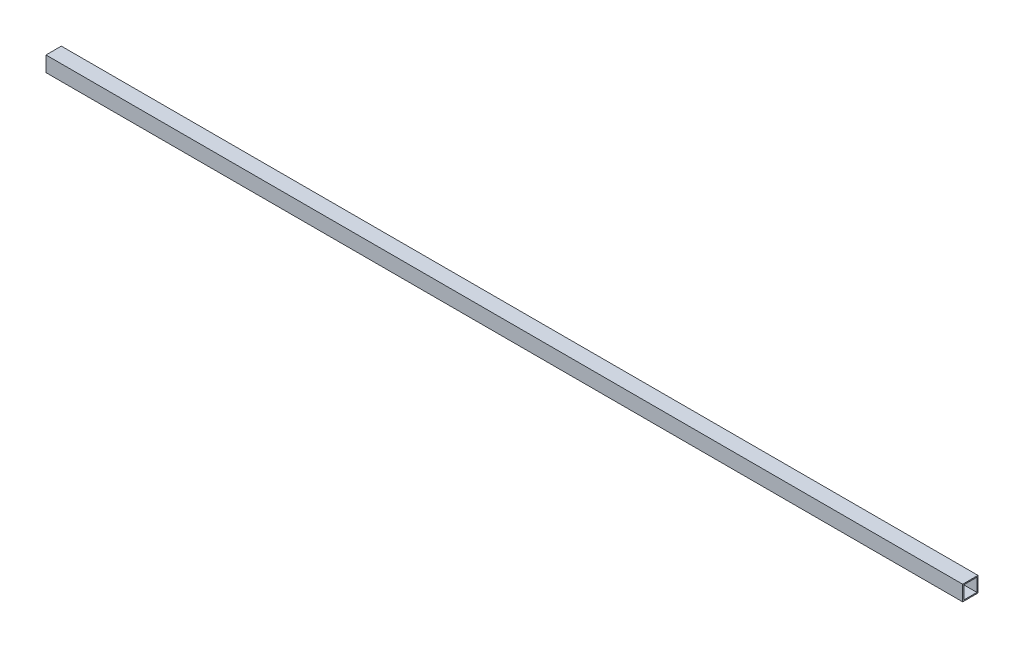
ISO-10303-21;
HEADER;
FILE_DESCRIPTION(('STEP AP214'),'2;1');
FILE_NAME('part.step','',(''),(''),'','','');
FILE_SCHEMA(('AUTOMOTIVE_DESIGN { 1 0 10303 214 1 1 1 1 }'));
ENDSEC;
DATA;
#1=APPLICATION_CONTEXT('core data for automotive mechanical design processes');
#2=APPLICATION_PROTOCOL_DEFINITION('international standard','automotive_design',2000,#1);
#3=PRODUCT_CONTEXT('',#1,'mechanical');
#4=PRODUCT('Part','Part','',(#3));
#5=PRODUCT_RELATED_PRODUCT_CATEGORY('part','',(#4));
#6=PRODUCT_DEFINITION_FORMATION('','',#4);
#7=PRODUCT_DEFINITION_CONTEXT('part definition',#1,'design');
#8=PRODUCT_DEFINITION('design','',#6,#7);
#9=PRODUCT_DEFINITION_SHAPE('','',#8);
#10=(LENGTH_UNIT() NAMED_UNIT(*) SI_UNIT(.MILLI.,.METRE.));
#11=(NAMED_UNIT(*) PLANE_ANGLE_UNIT() SI_UNIT($,.RADIAN.));
#12=(NAMED_UNIT(*) SI_UNIT($,.STERADIAN.) SOLID_ANGLE_UNIT());
#13=UNCERTAINTY_MEASURE_WITH_UNIT(LENGTH_MEASURE(1.E-05),#10,'distance_accuracy_value','');
#14=(GEOMETRIC_REPRESENTATION_CONTEXT(3) GLOBAL_UNCERTAINTY_ASSIGNED_CONTEXT((#13)) GLOBAL_UNIT_ASSIGNED_CONTEXT((#10,
#11,#12)) REPRESENTATION_CONTEXT('',''));
#15=CARTESIAN_POINT('',(0.,0.,0.));
#16=DIRECTION('',(0.,0.,1.));
#17=DIRECTION('',(1.,0.,0.));
#18=AXIS2_PLACEMENT_3D('',#15,#16,#17);
#19=CARTESIAN_POINT('',(2657.475,22.2250000000005,-22.225));
#20=DIRECTION('',(1.,0.,0.));
#21=DIRECTION('',(0.,1.,0.));
#22=AXIS2_PLACEMENT_3D('',#19,#20,#21);
#23=PLANE('',#22);
#24=DIRECTION('',(0.,1.,0.));
#25=VECTOR('',#24,1.);
#26=CARTESIAN_POINT('',(2657.475,22.2250000000005,0.));
#27=LINE('',#26,#25);
#28=CARTESIAN_POINT('',(2657.475,-1.94289029309402E-13,0.));
#29=VERTEX_POINT('',#28);
#30=CARTESIAN_POINT('',(2657.475,44.4500000000003,0.));
#31=VERTEX_POINT('',#30);
#32=EDGE_CURVE('E142',#29,#31,#27,.T.);
#33=ORIENTED_EDGE('',*,*,#32,.F.);
#34=DIRECTION('',(0.,0.,-1.));
#35=VECTOR('',#34,1.);
#36=CARTESIAN_POINT('',(2657.475,2.77555756156289E-13,-22.225));
#37=LINE('',#36,#35);
#38=CARTESIAN_POINT('',(2657.475,2.77555756156289E-13,-44.45));
#39=VERTEX_POINT('',#38);
#40=EDGE_CURVE('E146',#29,#39,#37,.T.);
#41=ORIENTED_EDGE('',*,*,#40,.T.);
#42=DIRECTION('',(0.,1.,0.));
#43=VECTOR('',#42,1.);
#44=CARTESIAN_POINT('',(2657.475,22.2250000000005,-44.45));
#45=LINE('',#44,#43);
#46=CARTESIAN_POINT('',(2657.475,44.4500000000004,-44.45));
#47=VERTEX_POINT('',#46);
#48=EDGE_CURVE('E150',#39,#47,#45,.T.);
#49=ORIENTED_EDGE('',*,*,#48,.T.);
#50=DIRECTION('',(0.,0.,-1.));
#51=VECTOR('',#50,1.);
#52=CARTESIAN_POINT('',(2657.475,44.4500000000005,-22.225));
#53=LINE('',#52,#51);
#54=EDGE_CURVE('E153',#31,#47,#53,.T.);
#55=ORIENTED_EDGE('',*,*,#54,.F.);
#56=EDGE_LOOP('',(#33,#41,#49,#55));
#57=FACE_BOUND('',#56,.T.);
#58=DIRECTION('',(0.,0.,-1.));
#59=VECTOR('',#58,1.);
#60=CARTESIAN_POINT('',(2657.475,3.17500000000029,-22.225));
#61=LINE('',#60,#59);
#62=CARTESIAN_POINT('',(2657.475,3.17500000000001,-3.17500000000004));
#63=VERTEX_POINT('',#62);
#64=CARTESIAN_POINT('',(2657.475,3.17500000000026,-41.275));
#65=VERTEX_POINT('',#64);
#66=EDGE_CURVE('E129',#63,#65,#61,.T.);
#67=ORIENTED_EDGE('',*,*,#66,.F.);
#68=DIRECTION('',(0.,1.,0.));
#69=VECTOR('',#68,1.);
#70=CARTESIAN_POINT('',(2657.475,22.2250000000005,-3.17500000000004));
#71=LINE('',#70,#69);
#72=CARTESIAN_POINT('',(2657.475,41.2750000000003,-3.17500000000004));
#73=VERTEX_POINT('',#72);
#74=EDGE_CURVE('E123',#63,#73,#71,.T.);
#75=ORIENTED_EDGE('',*,*,#74,.T.);
#76=DIRECTION('',(0.,0.,-1.));
#77=VECTOR('',#76,1.);
#78=CARTESIAN_POINT('',(2657.475,41.2750000000005,-22.225));
#79=LINE('',#78,#77);
#80=CARTESIAN_POINT('',(2657.475,41.2750000000004,-41.275));
#81=VERTEX_POINT('',#80);
#82=EDGE_CURVE('E105',#73,#81,#79,.T.);
#83=ORIENTED_EDGE('',*,*,#82,.T.);
#84=DIRECTION('',(0.,1.,0.));
#85=VECTOR('',#84,1.);
#86=CARTESIAN_POINT('',(2657.475,22.2250000000005,-41.275));
#87=LINE('',#86,#85);
#88=EDGE_CURVE('E138',#65,#81,#87,.T.);
#89=ORIENTED_EDGE('',*,*,#88,.F.);
#90=EDGE_LOOP('',(#67,#75,#83,#89));
#91=FACE_BOUND('',#90,.T.);
#92=ADVANCED_FACE('F14',(#57,#91),#23,.T.);
#93=CARTESIAN_POINT('',(0.,22.225,-22.225));
#94=DIRECTION('',(1.,0.,0.));
#95=DIRECTION('',(0.,1.,0.));
#96=AXIS2_PLACEMENT_3D('',#93,#94,#95);
#97=PLANE('',#96);
#98=DIRECTION('',(0.,1.,0.));
#99=VECTOR('',#98,1.);
#100=CARTESIAN_POINT('',(0.,22.225,0.));
#101=LINE('',#100,#99);
#102=CARTESIAN_POINT('',(0.,0.,0.));
#103=VERTEX_POINT('',#102);
#104=CARTESIAN_POINT('',(0.,44.4499999999996,0.));
#105=VERTEX_POINT('',#104);
#106=EDGE_CURVE('E158',#103,#105,#101,.T.);
#107=ORIENTED_EDGE('',*,*,#106,.T.);
#108=DIRECTION('',(0.,0.,-1.));
#109=VECTOR('',#108,1.);
#110=CARTESIAN_POINT('',(0.,44.4499999999999,-22.225));
#111=LINE('',#110,#109);
#112=CARTESIAN_POINT('',(0.,44.45,-44.45));
#113=VERTEX_POINT('',#112);
#114=EDGE_CURVE('E147',#105,#113,#111,.T.);
#115=ORIENTED_EDGE('',*,*,#114,.T.);
#116=DIRECTION('',(0.,1.,0.));
#117=VECTOR('',#116,1.);
#118=CARTESIAN_POINT('',(0.,22.225,-44.45));
#119=LINE('',#118,#117);
#120=CARTESIAN_POINT('',(0.,0.,-44.45));
#121=VERTEX_POINT('',#120);
#122=EDGE_CURVE('E165',#121,#113,#119,.T.);
#123=ORIENTED_EDGE('',*,*,#122,.F.);
#124=DIRECTION('',(0.,0.,-1.));
#125=VECTOR('',#124,1.);
#126=CARTESIAN_POINT('',(0.,0.,-22.225));
#127=LINE('',#126,#125);
#128=EDGE_CURVE('E162',#103,#121,#127,.T.);
#129=ORIENTED_EDGE('',*,*,#128,.F.);
#130=EDGE_LOOP('',(#107,#115,#123,#129));
#131=FACE_BOUND('',#130,.T.);
#132=DIRECTION('',(0.,1.,0.));
#133=VECTOR('',#132,1.);
#134=CARTESIAN_POINT('',(0.,22.225,-3.17499999999998));
#135=LINE('',#134,#133);
#136=CARTESIAN_POINT('',(0.,3.17500000000001,-3.17499999999998));
#137=VERTEX_POINT('',#136);
#138=CARTESIAN_POINT('',(0.,41.2749999999996,-3.17499999999998));
#139=VERTEX_POINT('',#138);
#140=EDGE_CURVE('E112',#137,#139,#135,.T.);
#141=ORIENTED_EDGE('',*,*,#140,.F.);
#142=DIRECTION('',(0.,0.,-1.));
#143=VECTOR('',#142,1.);
#144=CARTESIAN_POINT('',(0.,3.17500000000001,-22.225));
#145=LINE('',#144,#143);
#146=CARTESIAN_POINT('',(0.,3.17500000000001,-41.275));
#147=VERTEX_POINT('',#146);
#148=EDGE_CURVE('E119',#137,#147,#145,.T.);
#149=ORIENTED_EDGE('',*,*,#148,.T.);
#150=DIRECTION('',(0.,1.,0.));
#151=VECTOR('',#150,1.);
#152=CARTESIAN_POINT('',(0.,22.225,-41.275));
#153=LINE('',#152,#151);
#154=CARTESIAN_POINT('',(0.,41.275,-41.275));
#155=VERTEX_POINT('',#154);
#156=EDGE_CURVE('E46',#147,#155,#153,.T.);
#157=ORIENTED_EDGE('',*,*,#156,.T.);
#158=DIRECTION('',(0.,0.,-1.));
#159=VECTOR('',#158,1.);
#160=CARTESIAN_POINT('',(0.,41.2749999999999,-22.225));
#161=LINE('',#160,#159);
#162=EDGE_CURVE('E103',#139,#155,#161,.T.);
#163=ORIENTED_EDGE('',*,*,#162,.F.);
#164=EDGE_LOOP('',(#141,#149,#157,#163));
#165=FACE_BOUND('',#164,.T.);
#166=ADVANCED_FACE('F121',(#131,#165),#97,.F.);
#167=CARTESIAN_POINT('',(2657.475,22.2250000000005,0.));
#168=DIRECTION('',(0.,0.,1.));
#169=DIRECTION('',(1.,0.,0.));
#170=AXIS2_PLACEMENT_3D('',#167,#168,#169);
#171=PLANE('',#170);
#172=ORIENTED_EDGE('',*,*,#106,.F.);
#173=DIRECTION('',(-1.,0.,0.));
#174=VECTOR('',#173,1.);
#175=CARTESIAN_POINT('',(2657.475,-1.94289029309402E-13,0.));
#176=LINE('',#175,#174);
#177=EDGE_CURVE('E9',#29,#103,#176,.T.);
#178=ORIENTED_EDGE('',*,*,#177,.F.);
#179=ORIENTED_EDGE('',*,*,#32,.T.);
#180=DIRECTION('',(-1.,0.,0.));
#181=VECTOR('',#180,1.);
#182=CARTESIAN_POINT('',(2657.475,44.4500000000003,0.));
#183=LINE('',#182,#181);
#184=EDGE_CURVE('E157',#31,#105,#183,.T.);
#185=ORIENTED_EDGE('',*,*,#184,.T.);
#186=EDGE_LOOP('',(#172,#178,#179,#185));
#187=FACE_BOUND('',#186,.T.);
#188=ADVANCED_FACE('F16',(#187),#171,.T.);
#189=CARTESIAN_POINT('',(2657.475,2.77555756156289E-13,-22.225));
#190=DIRECTION('',(0.,1.,0.));
#191=DIRECTION('',(0.,0.,1.));
#192=AXIS2_PLACEMENT_3D('',#189,#190,#191);
#193=PLANE('',#192);
#194=ORIENTED_EDGE('',*,*,#128,.T.);
#195=DIRECTION('',(-1.,0.,0.));
#196=VECTOR('',#195,1.);
#197=CARTESIAN_POINT('',(2657.475,2.77555756156289E-13,-44.45));
#198=LINE('',#197,#196);
#199=EDGE_CURVE('E23',#39,#121,#198,.T.);
#200=ORIENTED_EDGE('',*,*,#199,.F.);
#201=ORIENTED_EDGE('',*,*,#40,.F.);
#202=ORIENTED_EDGE('',*,*,#177,.T.);
#203=EDGE_LOOP('',(#194,#200,#201,#202));
#204=FACE_BOUND('',#203,.T.);
#205=ADVANCED_FACE('F197',(#204),#193,.F.);
#206=CARTESIAN_POINT('',(2657.475,22.2250000000005,-44.45));
#207=DIRECTION('',(0.,0.,1.));
#208=DIRECTION('',(1.,0.,0.));
#209=AXIS2_PLACEMENT_3D('',#206,#207,#208);
#210=PLANE('',#209);
#211=ORIENTED_EDGE('',*,*,#122,.T.);
#212=DIRECTION('',(-1.,0.,0.));
#213=VECTOR('',#212,1.);
#214=CARTESIAN_POINT('',(2657.475,44.4500000000004,-44.45));
#215=LINE('',#214,#213);
#216=EDGE_CURVE('E174',#47,#113,#215,.T.);
#217=ORIENTED_EDGE('',*,*,#216,.F.);
#218=ORIENTED_EDGE('',*,*,#48,.F.);
#219=ORIENTED_EDGE('',*,*,#199,.T.);
#220=EDGE_LOOP('',(#211,#217,#218,#219));
#221=FACE_BOUND('',#220,.T.);
#222=ADVANCED_FACE('F183',(#221),#210,.F.);
#223=CARTESIAN_POINT('',(2657.475,44.4500000000005,-22.225));
#224=DIRECTION('',(0.,1.,0.));
#225=DIRECTION('',(0.,0.,1.));
#226=AXIS2_PLACEMENT_3D('',#223,#224,#225);
#227=PLANE('',#226);
#228=ORIENTED_EDGE('',*,*,#114,.F.);
#229=ORIENTED_EDGE('',*,*,#184,.F.);
#230=ORIENTED_EDGE('',*,*,#54,.T.);
#231=ORIENTED_EDGE('',*,*,#216,.T.);
#232=EDGE_LOOP('',(#228,#229,#230,#231));
#233=FACE_BOUND('',#232,.T.);
#234=ADVANCED_FACE('F192',(#233),#227,.T.);
#235=CARTESIAN_POINT('',(2657.475,22.2250000000005,-3.17500000000004));
#236=DIRECTION('',(0.,0.,1.));
#237=DIRECTION('',(1.,0.,0.));
#238=AXIS2_PLACEMENT_3D('',#235,#236,#237);
#239=PLANE('',#238);
#240=ORIENTED_EDGE('',*,*,#140,.T.);
#241=DIRECTION('',(-1.,0.,0.));
#242=VECTOR('',#241,1.);
#243=CARTESIAN_POINT('',(2657.475,41.2750000000003,-3.17500000000004));
#244=LINE('',#243,#242);
#245=EDGE_CURVE('E99',#73,#139,#244,.T.);
#246=ORIENTED_EDGE('',*,*,#245,.F.);
#247=ORIENTED_EDGE('',*,*,#74,.F.);
#248=DIRECTION('',(-1.,0.,0.));
#249=VECTOR('',#248,1.);
#250=CARTESIAN_POINT('',(2657.475,3.17500000000001,-3.17500000000004));
#251=LINE('',#250,#249);
#252=EDGE_CURVE('E114',#63,#137,#251,.T.);
#253=ORIENTED_EDGE('',*,*,#252,.T.);
#254=EDGE_LOOP('',(#240,#246,#247,#253));
#255=FACE_BOUND('',#254,.T.);
#256=ADVANCED_FACE('F113',(#255),#239,.F.);
#257=CARTESIAN_POINT('',(2657.475,3.17500000000029,-22.225));
#258=DIRECTION('',(0.,1.,0.));
#259=DIRECTION('',(0.,0.,1.));
#260=AXIS2_PLACEMENT_3D('',#257,#258,#259);
#261=PLANE('',#260);
#262=ORIENTED_EDGE('',*,*,#148,.F.);
#263=ORIENTED_EDGE('',*,*,#252,.F.);
#264=ORIENTED_EDGE('',*,*,#66,.T.);
#265=DIRECTION('',(-1.,0.,0.));
#266=VECTOR('',#265,1.);
#267=CARTESIAN_POINT('',(2657.475,3.17500000000026,-41.275));
#268=LINE('',#267,#266);
#269=EDGE_CURVE('E357',#65,#147,#268,.T.);
#270=ORIENTED_EDGE('',*,*,#269,.T.);
#271=EDGE_LOOP('',(#262,#263,#264,#270));
#272=FACE_BOUND('',#271,.T.);
#273=ADVANCED_FACE('F233',(#272),#261,.T.);
#274=CARTESIAN_POINT('',(2657.475,22.2250000000005,-41.275));
#275=DIRECTION('',(0.,0.,1.));
#276=DIRECTION('',(1.,0.,0.));
#277=AXIS2_PLACEMENT_3D('',#274,#275,#276);
#278=PLANE('',#277);
#279=ORIENTED_EDGE('',*,*,#156,.F.);
#280=ORIENTED_EDGE('',*,*,#269,.F.);
#281=ORIENTED_EDGE('',*,*,#88,.T.);
#282=DIRECTION('',(-1.,0.,0.));
#283=VECTOR('',#282,1.);
#284=CARTESIAN_POINT('',(2657.475,41.2750000000004,-41.275));
#285=LINE('',#284,#283);
#286=EDGE_CURVE('E35',#81,#155,#285,.T.);
#287=ORIENTED_EDGE('',*,*,#286,.T.);
#288=EDGE_LOOP('',(#279,#280,#281,#287));
#289=FACE_BOUND('',#288,.T.);
#290=ADVANCED_FACE('F240',(#289),#278,.T.);
#291=CARTESIAN_POINT('',(2657.475,41.2750000000005,-22.225));
#292=DIRECTION('',(0.,1.,0.));
#293=DIRECTION('',(0.,0.,1.));
#294=AXIS2_PLACEMENT_3D('',#291,#292,#293);
#295=PLANE('',#294);
#296=ORIENTED_EDGE('',*,*,#162,.T.);
#297=ORIENTED_EDGE('',*,*,#286,.F.);
#298=ORIENTED_EDGE('',*,*,#82,.F.);
#299=ORIENTED_EDGE('',*,*,#245,.T.);
#300=EDGE_LOOP('',(#296,#297,#298,#299));
#301=FACE_BOUND('',#300,.T.);
#302=ADVANCED_FACE('F101',(#301),#295,.F.);
#303=CLOSED_SHELL('',(#92,#166,#188,#205,#222,#234,#256,#273,#290,#302));
#304=MANIFOLD_SOLID_BREP('B1',#303);
#305=ADVANCED_BREP_SHAPE_REPRESENTATION('',(#18,#304),#14);
#306=SHAPE_DEFINITION_REPRESENTATION(#9,#305);
ENDSEC;
END-ISO-10303-21;
